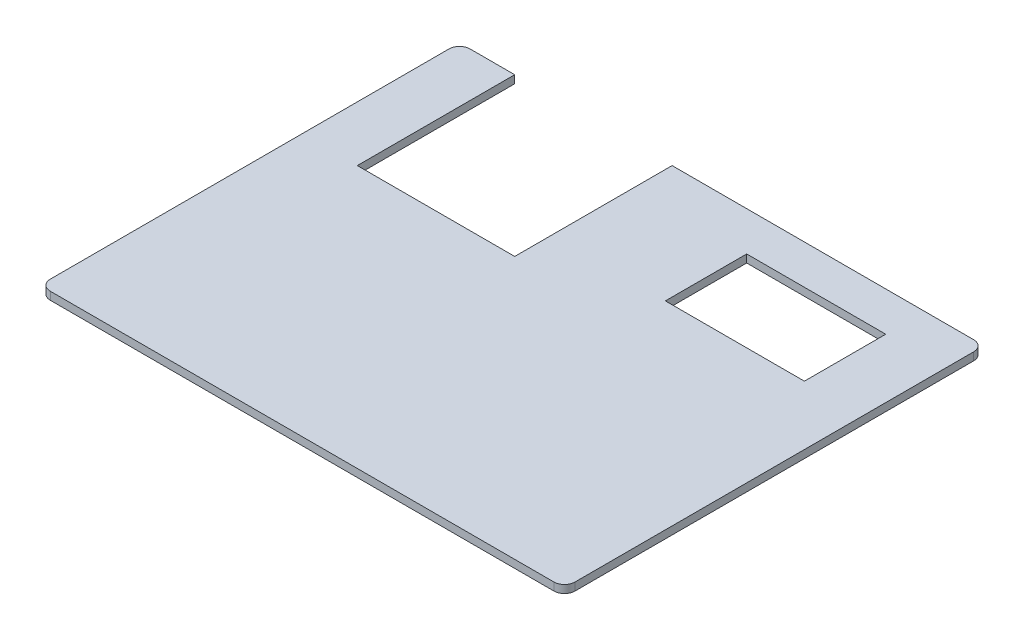
ISO-10303-21;
HEADER;
FILE_DESCRIPTION(('STEP AP214'),'2;1');
FILE_NAME('part.step','',(''),(''),'','','');
FILE_SCHEMA(('AUTOMOTIVE_DESIGN { 1 0 10303 214 1 1 1 1 }'));
ENDSEC;
DATA;
#1=APPLICATION_CONTEXT('core data for automotive mechanical design processes');
#2=APPLICATION_PROTOCOL_DEFINITION('international standard','automotive_design',2000,#1);
#3=PRODUCT_CONTEXT('',#1,'mechanical');
#4=PRODUCT('Part','Part','',(#3));
#5=PRODUCT_RELATED_PRODUCT_CATEGORY('part','',(#4));
#6=PRODUCT_DEFINITION_FORMATION('','',#4);
#7=PRODUCT_DEFINITION_CONTEXT('part definition',#1,'design');
#8=PRODUCT_DEFINITION('design','',#6,#7);
#9=PRODUCT_DEFINITION_SHAPE('','',#8);
#10=(LENGTH_UNIT() NAMED_UNIT(*) SI_UNIT(.MILLI.,.METRE.));
#11=(NAMED_UNIT(*) PLANE_ANGLE_UNIT() SI_UNIT($,.RADIAN.));
#12=(NAMED_UNIT(*) SI_UNIT($,.STERADIAN.) SOLID_ANGLE_UNIT());
#13=UNCERTAINTY_MEASURE_WITH_UNIT(LENGTH_MEASURE(1.E-05),#10,'distance_accuracy_value','');
#14=(GEOMETRIC_REPRESENTATION_CONTEXT(3) GLOBAL_UNCERTAINTY_ASSIGNED_CONTEXT((#13)) GLOBAL_UNIT_ASSIGNED_CONTEXT((#10,
#11,#12)) REPRESENTATION_CONTEXT('',''));
#15=CARTESIAN_POINT('',(0.,0.,0.));
#16=DIRECTION('',(0.,0.,1.));
#17=DIRECTION('',(1.,0.,0.));
#18=AXIS2_PLACEMENT_3D('',#15,#16,#17);
#19=CARTESIAN_POINT('',(0.,1.5,0.));
#20=DIRECTION('',(0.,1.,0.));
#21=DIRECTION('',(0.,0.,1.));
#22=AXIS2_PLACEMENT_3D('',#19,#20,#21);
#23=PLANE('',#22);
#24=DIRECTION('',(0.,0.,1.));
#25=VECTOR('',#24,1.);
#26=CARTESIAN_POINT('',(-16.5457682624405,1.5,-48.8118811881188));
#27=LINE('',#26,#25);
#28=CARTESIAN_POINT('',(-16.5457682624405,1.5,-48.8118811881188));
#29=VERTEX_POINT('',#28);
#30=CARTESIAN_POINT('',(-16.5457682624405,1.5,-18.8118811881188));
#31=VERTEX_POINT('',#30);
#32=EDGE_CURVE('E206',#29,#31,#27,.T.);
#33=ORIENTED_EDGE('',*,*,#32,.F.);
#34=DIRECTION('',(-1.,0.,0.));
#35=VECTOR('',#34,1.);
#36=CARTESIAN_POINT('',(-27.0627062706271,1.5,-48.8118811881188));
#37=LINE('',#36,#35);
#38=CARTESIAN_POINT('',(-25.0627062706271,1.5,-48.8118811881188));
#39=VERTEX_POINT('',#38);
#40=EDGE_CURVE('E244',#29,#39,#37,.T.);
#41=ORIENTED_EDGE('',*,*,#40,.T.);
#42=CARTESIAN_POINT('',(-25.0627062706271,1.5,-46.8118811881188));
#43=DIRECTION('',(0.,1.,0.));
#44=DIRECTION('',(0.,0.,1.));
#45=AXIS2_PLACEMENT_3D('',#42,#43,#44);
#46=CIRCLE('',#45,2.);
#47=CARTESIAN_POINT('',(-27.0627062706271,1.5,-46.8118811881188));
#48=VERTEX_POINT('',#47);
#49=EDGE_CURVE('E297',#39,#48,#46,.T.);
#50=ORIENTED_EDGE('',*,*,#49,.T.);
#51=DIRECTION('',(0.,0.,1.));
#52=VECTOR('',#51,1.);
#53=CARTESIAN_POINT('',(-27.0627062706271,1.5,-48.8118811881188));
#54=LINE('',#53,#52);
#55=CARTESIAN_POINT('',(-27.0627062706271,1.5,29.1881188118812));
#56=VERTEX_POINT('',#55);
#57=EDGE_CURVE('E231',#48,#56,#54,.T.);
#58=ORIENTED_EDGE('',*,*,#57,.T.);
#59=CARTESIAN_POINT('',(-25.0627062706271,1.5,29.1881188118812));
#60=DIRECTION('',(0.,1.,0.));
#61=DIRECTION('',(0.,0.,1.));
#62=AXIS2_PLACEMENT_3D('',#59,#60,#61);
#63=CIRCLE('',#62,2.);
#64=CARTESIAN_POINT('',(-25.0627062706271,1.5,31.1881188118812));
#65=VERTEX_POINT('',#64);
#66=EDGE_CURVE('E300',#56,#65,#63,.T.);
#67=ORIENTED_EDGE('',*,*,#66,.T.);
#68=DIRECTION('',(1.,0.,0.));
#69=VECTOR('',#68,1.);
#70=CARTESIAN_POINT('',(-27.0627062706271,1.5,31.1881188118812));
#71=LINE('',#70,#69);
#72=CARTESIAN_POINT('',(70.937293729373,1.5,31.1881188118812));
#73=VERTEX_POINT('',#72);
#74=EDGE_CURVE('E235',#65,#73,#71,.T.);
#75=ORIENTED_EDGE('',*,*,#74,.T.);
#76=CARTESIAN_POINT('',(70.937293729373,1.5,29.1881188118812));
#77=DIRECTION('',(0.,1.,0.));
#78=DIRECTION('',(0.,0.,1.));
#79=AXIS2_PLACEMENT_3D('',#76,#77,#78);
#80=CIRCLE('',#79,2.);
#81=CARTESIAN_POINT('',(72.937293729373,1.5,29.1881188118812));
#82=VERTEX_POINT('',#81);
#83=EDGE_CURVE('E291',#73,#82,#80,.T.);
#84=ORIENTED_EDGE('',*,*,#83,.T.);
#85=DIRECTION('',(0.,0.,-1.));
#86=VECTOR('',#85,1.);
#87=CARTESIAN_POINT('',(72.937293729373,1.5,-48.8118811881188));
#88=LINE('',#87,#86);
#89=CARTESIAN_POINT('',(72.937293729373,1.5,-46.8118811881188));
#90=VERTEX_POINT('',#89);
#91=EDGE_CURVE('E240',#82,#90,#88,.T.);
#92=ORIENTED_EDGE('',*,*,#91,.T.);
#93=CARTESIAN_POINT('',(70.9372937293729,1.5,-46.8118811881188));
#94=DIRECTION('',(0.,1.,0.));
#95=DIRECTION('',(0.,0.,1.));
#96=AXIS2_PLACEMENT_3D('',#93,#94,#95);
#97=CIRCLE('',#96,2.);
#98=CARTESIAN_POINT('',(70.9372937293729,1.5,-48.8118811881188));
#99=VERTEX_POINT('',#98);
#100=EDGE_CURVE('E294',#90,#99,#97,.T.);
#101=ORIENTED_EDGE('',*,*,#100,.T.);
#102=CARTESIAN_POINT('',(13.4542317375595,1.5,-48.8118811881188));
#103=VERTEX_POINT('',#102);
#104=EDGE_CURVE('E245',#99,#103,#37,.T.);
#105=ORIENTED_EDGE('',*,*,#104,.T.);
#106=DIRECTION('',(0.,0.,-1.));
#107=VECTOR('',#106,1.);
#108=CARTESIAN_POINT('',(13.4542317375595,1.5,-48.8118811881188));
#109=LINE('',#108,#107);
#110=CARTESIAN_POINT('',(13.4542317375595,1.5,-18.8118811881188));
#111=VERTEX_POINT('',#110);
#112=EDGE_CURVE('E214',#111,#103,#109,.T.);
#113=ORIENTED_EDGE('',*,*,#112,.F.);
#114=DIRECTION('',(1.,0.,0.));
#115=VECTOR('',#114,1.);
#116=CARTESIAN_POINT('',(-16.5457682624405,1.5,-18.8118811881188));
#117=LINE('',#116,#115);
#118=EDGE_CURVE('E210',#31,#111,#117,.T.);
#119=ORIENTED_EDGE('',*,*,#118,.F.);
#120=EDGE_LOOP('',(#33,#41,#50,#58,#67,#75,#84,#92,#101,#105,#113,#119));
#121=FACE_BOUND('',#120,.T.);
#122=DIRECTION('',(-1.,0.,0.));
#123=VECTOR('',#122,1.);
#124=CARTESIAN_POINT('',(0.,1.5,-25.833205548279));
#125=LINE('',#124,#123);
#126=CARTESIAN_POINT('',(61.6504997430114,1.5,-25.833205548279));
#127=VERTEX_POINT('',#126);
#128=CARTESIAN_POINT('',(35.1504997430114,1.5,-25.833205548279));
#129=VERTEX_POINT('',#128);
#130=EDGE_CURVE('E201',#127,#129,#125,.T.);
#131=ORIENTED_EDGE('',*,*,#130,.T.);
#132=DIRECTION('',(0.,0.,-1.));
#133=VECTOR('',#132,1.);
#134=CARTESIAN_POINT('',(35.1504997430114,1.5,0.));
#135=LINE('',#134,#133);
#136=CARTESIAN_POINT('',(35.1504997430114,1.5,-41.333205548279));
#137=VERTEX_POINT('',#136);
#138=EDGE_CURVE('E160',#129,#137,#135,.T.);
#139=ORIENTED_EDGE('',*,*,#138,.T.);
#140=DIRECTION('',(1.,0.,0.));
#141=VECTOR('',#140,1.);
#142=CARTESIAN_POINT('',(0.,1.5,-41.333205548279));
#143=LINE('',#142,#141);
#144=CARTESIAN_POINT('',(61.6504997430114,1.5,-41.333205548279));
#145=VERTEX_POINT('',#144);
#146=EDGE_CURVE('E164',#137,#145,#143,.T.);
#147=ORIENTED_EDGE('',*,*,#146,.T.);
#148=DIRECTION('',(0.,0.,1.));
#149=VECTOR('',#148,1.);
#150=CARTESIAN_POINT('',(61.6504997430114,1.5,0.));
#151=LINE('',#150,#149);
#152=EDGE_CURVE('E197',#145,#127,#151,.T.);
#153=ORIENTED_EDGE('',*,*,#152,.T.);
#154=EDGE_LOOP('',(#131,#139,#147,#153));
#155=FACE_BOUND('',#154,.T.);
#156=ADVANCED_FACE('F43',(#121,#155),#23,.T.);
#157=CARTESIAN_POINT('',(0.,0.,0.));
#158=DIRECTION('',(0.,1.,0.));
#159=DIRECTION('',(0.,0.,1.));
#160=AXIS2_PLACEMENT_3D('',#157,#158,#159);
#161=PLANE('',#160);
#162=DIRECTION('',(-1.,0.,0.));
#163=VECTOR('',#162,1.);
#164=CARTESIAN_POINT('',(-27.0627062706271,0.,-48.8118811881188));
#165=LINE('',#164,#163);
#166=CARTESIAN_POINT('',(-16.5457682624405,0.,-48.8118811881188));
#167=VERTEX_POINT('',#166);
#168=CARTESIAN_POINT('',(-25.0627062706271,0.,-48.8118811881188));
#169=VERTEX_POINT('',#168);
#170=EDGE_CURVE('E261',#167,#169,#165,.T.);
#171=ORIENTED_EDGE('',*,*,#170,.F.);
#172=DIRECTION('',(0.,0.,1.));
#173=VECTOR('',#172,1.);
#174=CARTESIAN_POINT('',(-16.5457682624405,0.,0.));
#175=LINE('',#174,#173);
#176=CARTESIAN_POINT('',(-16.5457682624405,0.,-18.8118811881188));
#177=VERTEX_POINT('',#176);
#178=EDGE_CURVE('E11',#167,#177,#175,.T.);
#179=ORIENTED_EDGE('',*,*,#178,.T.);
#180=DIRECTION('',(1.,0.,0.));
#181=VECTOR('',#180,1.);
#182=CARTESIAN_POINT('',(0.,0.,-18.8118811881188));
#183=LINE('',#182,#181);
#184=CARTESIAN_POINT('',(13.4542317375595,0.,-18.8118811881188));
#185=VERTEX_POINT('',#184);
#186=EDGE_CURVE('E318',#177,#185,#183,.T.);
#187=ORIENTED_EDGE('',*,*,#186,.T.);
#188=DIRECTION('',(0.,0.,-1.));
#189=VECTOR('',#188,1.);
#190=CARTESIAN_POINT('',(13.4542317375595,0.,0.));
#191=LINE('',#190,#189);
#192=CARTESIAN_POINT('',(13.4542317375595,0.,-48.8118811881188));
#193=VERTEX_POINT('',#192);
#194=EDGE_CURVE('E52',#185,#193,#191,.T.);
#195=ORIENTED_EDGE('',*,*,#194,.T.);
#196=CARTESIAN_POINT('',(70.9372937293729,0.,-48.8118811881188));
#197=VERTEX_POINT('',#196);
#198=EDGE_CURVE('E236',#197,#193,#165,.T.);
#199=ORIENTED_EDGE('',*,*,#198,.F.);
#200=CARTESIAN_POINT('',(70.9372937293729,0.,-46.8118811881188));
#201=DIRECTION('',(0.,1.,0.));
#202=DIRECTION('',(0.,0.,1.));
#203=AXIS2_PLACEMENT_3D('',#200,#201,#202);
#204=CIRCLE('',#203,2.);
#205=CARTESIAN_POINT('',(72.937293729373,0.,-46.8118811881188));
#206=VERTEX_POINT('',#205);
#207=EDGE_CURVE('E274',#197,#206,#204,.F.);
#208=ORIENTED_EDGE('',*,*,#207,.T.);
#209=DIRECTION('',(0.,0.,-1.));
#210=VECTOR('',#209,1.);
#211=CARTESIAN_POINT('',(72.937293729373,0.,-48.8118811881188));
#212=LINE('',#211,#210);
#213=CARTESIAN_POINT('',(72.937293729373,0.,29.1881188118812));
#214=VERTEX_POINT('',#213);
#215=EDGE_CURVE('E257',#214,#206,#212,.T.);
#216=ORIENTED_EDGE('',*,*,#215,.F.);
#217=CARTESIAN_POINT('',(70.937293729373,0.,29.1881188118812));
#218=DIRECTION('',(0.,1.,0.));
#219=DIRECTION('',(0.,0.,1.));
#220=AXIS2_PLACEMENT_3D('',#217,#218,#219);
#221=CIRCLE('',#220,2.);
#222=CARTESIAN_POINT('',(70.937293729373,0.,31.1881188118812));
#223=VERTEX_POINT('',#222);
#224=EDGE_CURVE('E271',#214,#223,#221,.F.);
#225=ORIENTED_EDGE('',*,*,#224,.T.);
#226=DIRECTION('',(1.,0.,0.));
#227=VECTOR('',#226,1.);
#228=CARTESIAN_POINT('',(-27.0627062706271,0.,31.1881188118812));
#229=LINE('',#228,#227);
#230=CARTESIAN_POINT('',(-25.0627062706271,0.,31.1881188118812));
#231=VERTEX_POINT('',#230);
#232=EDGE_CURVE('E253',#231,#223,#229,.T.);
#233=ORIENTED_EDGE('',*,*,#232,.F.);
#234=CARTESIAN_POINT('',(-25.0627062706271,0.,29.1881188118812));
#235=DIRECTION('',(0.,1.,0.));
#236=DIRECTION('',(0.,0.,1.));
#237=AXIS2_PLACEMENT_3D('',#234,#235,#236);
#238=CIRCLE('',#237,2.);
#239=CARTESIAN_POINT('',(-27.0627062706271,0.,29.1881188118812));
#240=VERTEX_POINT('',#239);
#241=EDGE_CURVE('E281',#231,#240,#238,.F.);
#242=ORIENTED_EDGE('',*,*,#241,.T.);
#243=DIRECTION('',(0.,0.,1.));
#244=VECTOR('',#243,1.);
#245=CARTESIAN_POINT('',(-27.0627062706271,0.,-48.8118811881188));
#246=LINE('',#245,#244);
#247=CARTESIAN_POINT('',(-27.0627062706271,0.,-46.8118811881188));
#248=VERTEX_POINT('',#247);
#249=EDGE_CURVE('E221',#248,#240,#246,.T.);
#250=ORIENTED_EDGE('',*,*,#249,.F.);
#251=CARTESIAN_POINT('',(-25.0627062706271,0.,-46.8118811881188));
#252=DIRECTION('',(0.,1.,0.));
#253=DIRECTION('',(0.,0.,1.));
#254=AXIS2_PLACEMENT_3D('',#251,#252,#253);
#255=CIRCLE('',#254,2.);
#256=EDGE_CURVE('E277',#248,#169,#255,.F.);
#257=ORIENTED_EDGE('',*,*,#256,.T.);
#258=EDGE_LOOP('',(#171,#179,#187,#195,#199,#208,#216,#225,#233,#242,#250,#257));
#259=FACE_BOUND('',#258,.T.);
#260=DIRECTION('',(0.,0.,1.));
#261=VECTOR('',#260,1.);
#262=CARTESIAN_POINT('',(35.1504997430114,0.,-41.333205548279));
#263=LINE('',#262,#261);
#264=CARTESIAN_POINT('',(35.1504997430114,0.,-41.333205548279));
#265=VERTEX_POINT('',#264);
#266=CARTESIAN_POINT('',(35.1504997430114,0.,-25.833205548279));
#267=VERTEX_POINT('',#266);
#268=EDGE_CURVE('E67',#265,#267,#263,.T.);
#269=ORIENTED_EDGE('',*,*,#268,.T.);
#270=DIRECTION('',(1.,0.,0.));
#271=VECTOR('',#270,1.);
#272=CARTESIAN_POINT('',(35.1504997430114,0.,-25.833205548279));
#273=LINE('',#272,#271);
#274=CARTESIAN_POINT('',(61.6504997430114,0.,-25.833205548279));
#275=VERTEX_POINT('',#274);
#276=EDGE_CURVE('E168',#267,#275,#273,.T.);
#277=ORIENTED_EDGE('',*,*,#276,.T.);
#278=DIRECTION('',(0.,0.,-1.));
#279=VECTOR('',#278,1.);
#280=CARTESIAN_POINT('',(61.6504997430114,0.,-41.333205548279));
#281=LINE('',#280,#279);
#282=CARTESIAN_POINT('',(61.6504997430114,0.,-41.333205548279));
#283=VERTEX_POINT('',#282);
#284=EDGE_CURVE('E175',#275,#283,#281,.T.);
#285=ORIENTED_EDGE('',*,*,#284,.T.);
#286=DIRECTION('',(-1.,0.,0.));
#287=VECTOR('',#286,1.);
#288=CARTESIAN_POINT('',(35.1504997430114,0.,-41.333205548279));
#289=LINE('',#288,#287);
#290=EDGE_CURVE('E179',#283,#265,#289,.T.);
#291=ORIENTED_EDGE('',*,*,#290,.T.);
#292=EDGE_LOOP('',(#269,#277,#285,#291));
#293=FACE_BOUND('',#292,.T.);
#294=ADVANCED_FACE('F178',(#259,#293),#161,.F.);
#295=CARTESIAN_POINT('',(-27.0627062706271,1.5,-48.8118811881188));
#296=DIRECTION('',(0.,0.,1.));
#297=DIRECTION('',(1.,0.,0.));
#298=AXIS2_PLACEMENT_3D('',#295,#296,#297);
#299=PLANE('',#298);
#300=ORIENTED_EDGE('',*,*,#40,.F.);
#301=DIRECTION('',(0.,1.,0.));
#302=VECTOR('',#301,1.);
#303=CARTESIAN_POINT('',(-16.5457682624405,-6.,-48.8118811881188));
#304=LINE('',#303,#302);
#305=EDGE_CURVE('E218',#167,#29,#304,.T.);
#306=ORIENTED_EDGE('',*,*,#305,.F.);
#307=ORIENTED_EDGE('',*,*,#170,.T.);
#308=DIRECTION('',(0.,-1.,0.));
#309=VECTOR('',#308,1.);
#310=CARTESIAN_POINT('',(-25.0627062706271,1.5,-48.8118811881188));
#311=LINE('',#310,#309);
#312=EDGE_CURVE('E307',#169,#39,#311,.F.);
#313=ORIENTED_EDGE('',*,*,#312,.T.);
#314=EDGE_LOOP('',(#300,#306,#307,#313));
#315=FACE_BOUND('',#314,.T.);
#316=ADVANCED_FACE('F371',(#315),#299,.F.);
#317=CARTESIAN_POINT('',(-27.0627062706271,1.5,-48.8118811881188));
#318=DIRECTION('',(1.,0.,0.));
#319=DIRECTION('',(0.,0.,-1.));
#320=AXIS2_PLACEMENT_3D('',#317,#318,#319);
#321=PLANE('',#320);
#322=ORIENTED_EDGE('',*,*,#249,.T.);
#323=DIRECTION('',(0.,-1.,0.));
#324=VECTOR('',#323,1.);
#325=CARTESIAN_POINT('',(-27.0627062706271,1.5,29.1881188118812));
#326=LINE('',#325,#324);
#327=EDGE_CURVE('E288',#240,#56,#326,.F.);
#328=ORIENTED_EDGE('',*,*,#327,.T.);
#329=ORIENTED_EDGE('',*,*,#57,.F.);
#330=DIRECTION('',(0.,-1.,0.));
#331=VECTOR('',#330,1.);
#332=CARTESIAN_POINT('',(-27.0627062706271,1.5,-46.8118811881188));
#333=LINE('',#332,#331);
#334=EDGE_CURVE('E284',#48,#248,#333,.T.);
#335=ORIENTED_EDGE('',*,*,#334,.T.);
#336=EDGE_LOOP('',(#322,#328,#329,#335));
#337=FACE_BOUND('',#336,.T.);
#338=ADVANCED_FACE('F355',(#337),#321,.F.);
#339=CARTESIAN_POINT('',(-27.0627062706271,1.5,31.1881188118812));
#340=DIRECTION('',(0.,0.,-1.));
#341=DIRECTION('',(-1.,0.,0.));
#342=AXIS2_PLACEMENT_3D('',#339,#340,#341);
#343=PLANE('',#342);
#344=ORIENTED_EDGE('',*,*,#74,.F.);
#345=DIRECTION('',(0.,-1.,0.));
#346=VECTOR('',#345,1.);
#347=CARTESIAN_POINT('',(-25.0627062706271,1.5,31.1881188118812));
#348=LINE('',#347,#346);
#349=EDGE_CURVE('E267',#65,#231,#348,.T.);
#350=ORIENTED_EDGE('',*,*,#349,.T.);
#351=ORIENTED_EDGE('',*,*,#232,.T.);
#352=DIRECTION('',(0.,-1.,0.));
#353=VECTOR('',#352,1.);
#354=CARTESIAN_POINT('',(70.937293729373,1.5,31.1881188118812));
#355=LINE('',#354,#353);
#356=EDGE_CURVE('E249',#223,#73,#355,.F.);
#357=ORIENTED_EDGE('',*,*,#356,.T.);
#358=EDGE_LOOP('',(#344,#350,#351,#357));
#359=FACE_BOUND('',#358,.T.);
#360=ADVANCED_FACE('F347',(#359),#343,.F.);
#361=CARTESIAN_POINT('',(72.937293729373,1.5,-48.8118811881188));
#362=DIRECTION('',(-1.,0.,0.));
#363=DIRECTION('',(0.,0.,1.));
#364=AXIS2_PLACEMENT_3D('',#361,#362,#363);
#365=PLANE('',#364);
#366=ORIENTED_EDGE('',*,*,#215,.T.);
#367=DIRECTION('',(0.,-1.,0.));
#368=VECTOR('',#367,1.);
#369=CARTESIAN_POINT('',(72.937293729373,1.5,-46.8118811881188));
#370=LINE('',#369,#368);
#371=EDGE_CURVE('E315',#206,#90,#370,.F.);
#372=ORIENTED_EDGE('',*,*,#371,.T.);
#373=ORIENTED_EDGE('',*,*,#91,.F.);
#374=DIRECTION('',(0.,-1.,0.));
#375=VECTOR('',#374,1.);
#376=CARTESIAN_POINT('',(72.937293729373,1.5,29.1881188118812));
#377=LINE('',#376,#375);
#378=EDGE_CURVE('E311',#82,#214,#377,.T.);
#379=ORIENTED_EDGE('',*,*,#378,.T.);
#380=EDGE_LOOP('',(#366,#372,#373,#379));
#381=FACE_BOUND('',#380,.T.);
#382=ADVANCED_FACE('F338',(#381),#365,.F.);
#383=ORIENTED_EDGE('',*,*,#198,.T.);
#384=DIRECTION('',(0.,1.,0.));
#385=VECTOR('',#384,1.);
#386=CARTESIAN_POINT('',(13.4542317375595,-6.,-48.8118811881188));
#387=LINE('',#386,#385);
#388=EDGE_CURVE('E222',#193,#103,#387,.T.);
#389=ORIENTED_EDGE('',*,*,#388,.T.);
#390=ORIENTED_EDGE('',*,*,#104,.F.);
#391=DIRECTION('',(0.,-1.,0.));
#392=VECTOR('',#391,1.);
#393=CARTESIAN_POINT('',(70.9372937293729,1.5,-48.8118811881188));
#394=LINE('',#393,#392);
#395=EDGE_CURVE('E303',#99,#197,#394,.T.);
#396=ORIENTED_EDGE('',*,*,#395,.T.);
#397=EDGE_LOOP('',(#383,#389,#390,#396));
#398=FACE_BOUND('',#397,.T.);
#399=ADVANCED_FACE('F329',(#398),#299,.F.);
#400=CARTESIAN_POINT('',(-25.0627062706271,1.5,29.1881188118812));
#401=DIRECTION('',(0.,-1.,0.));
#402=DIRECTION('',(0.,0.,-1.));
#403=AXIS2_PLACEMENT_3D('',#400,#401,#402);
#404=CYLINDRICAL_SURFACE('',#403,2.);
#405=ORIENTED_EDGE('',*,*,#66,.F.);
#406=ORIENTED_EDGE('',*,*,#327,.F.);
#407=ORIENTED_EDGE('',*,*,#241,.F.);
#408=ORIENTED_EDGE('',*,*,#349,.F.);
#409=EDGE_LOOP('',(#405,#406,#407,#408));
#410=FACE_BOUND('',#409,.T.);
#411=ADVANCED_FACE('F351',(#410),#404,.T.);
#412=CARTESIAN_POINT('',(-25.0627062706271,1.5,-46.8118811881188));
#413=DIRECTION('',(0.,-1.,0.));
#414=DIRECTION('',(0.,0.,-1.));
#415=AXIS2_PLACEMENT_3D('',#412,#413,#414);
#416=CYLINDRICAL_SURFACE('',#415,2.);
#417=ORIENTED_EDGE('',*,*,#49,.F.);
#418=ORIENTED_EDGE('',*,*,#312,.F.);
#419=ORIENTED_EDGE('',*,*,#256,.F.);
#420=ORIENTED_EDGE('',*,*,#334,.F.);
#421=EDGE_LOOP('',(#417,#418,#419,#420));
#422=FACE_BOUND('',#421,.T.);
#423=ADVANCED_FACE('F360',(#422),#416,.T.);
#424=CARTESIAN_POINT('',(70.9372937293729,1.5,-46.8118811881188));
#425=DIRECTION('',(0.,-1.,0.));
#426=DIRECTION('',(0.,0.,-1.));
#427=AXIS2_PLACEMENT_3D('',#424,#425,#426);
#428=CYLINDRICAL_SURFACE('',#427,2.);
#429=ORIENTED_EDGE('',*,*,#100,.F.);
#430=ORIENTED_EDGE('',*,*,#371,.F.);
#431=ORIENTED_EDGE('',*,*,#207,.F.);
#432=ORIENTED_EDGE('',*,*,#395,.F.);
#433=EDGE_LOOP('',(#429,#430,#431,#432));
#434=FACE_BOUND('',#433,.T.);
#435=ADVANCED_FACE('F334',(#434),#428,.T.);
#436=CARTESIAN_POINT('',(70.937293729373,1.5,29.1881188118812));
#437=DIRECTION('',(0.,-1.,0.));
#438=DIRECTION('',(0.,0.,-1.));
#439=AXIS2_PLACEMENT_3D('',#436,#437,#438);
#440=CYLINDRICAL_SURFACE('',#439,2.);
#441=ORIENTED_EDGE('',*,*,#83,.F.);
#442=ORIENTED_EDGE('',*,*,#356,.F.);
#443=ORIENTED_EDGE('',*,*,#224,.F.);
#444=ORIENTED_EDGE('',*,*,#378,.F.);
#445=EDGE_LOOP('',(#441,#442,#443,#444));
#446=FACE_BOUND('',#445,.T.);
#447=ADVANCED_FACE('F45',(#446),#440,.T.);
#448=CARTESIAN_POINT('',(-16.5457682624405,-6.,-48.8118811881188));
#449=DIRECTION('',(-1.,0.,0.));
#450=DIRECTION('',(0.,0.,1.));
#451=AXIS2_PLACEMENT_3D('',#448,#449,#450);
#452=PLANE('',#451);
#453=ORIENTED_EDGE('',*,*,#305,.T.);
#454=ORIENTED_EDGE('',*,*,#32,.T.);
#455=DIRECTION('',(0.,1.,0.));
#456=VECTOR('',#455,1.);
#457=CARTESIAN_POINT('',(-16.5457682624405,-6.,-18.8118811881188));
#458=LINE('',#457,#456);
#459=EDGE_CURVE('E217',#177,#31,#458,.T.);
#460=ORIENTED_EDGE('',*,*,#459,.F.);
#461=ORIENTED_EDGE('',*,*,#178,.F.);
#462=EDGE_LOOP('',(#453,#454,#460,#461));
#463=FACE_BOUND('',#462,.T.);
#464=ADVANCED_FACE('F387',(#463),#452,.F.);
#465=CARTESIAN_POINT('',(13.4542317375595,-6.,-48.8118811881188));
#466=DIRECTION('',(1.,0.,0.));
#467=DIRECTION('',(0.,0.,-1.));
#468=AXIS2_PLACEMENT_3D('',#465,#466,#467);
#469=PLANE('',#468);
#470=DIRECTION('',(0.,1.,0.));
#471=VECTOR('',#470,1.);
#472=CARTESIAN_POINT('',(13.4542317375595,-6.,-18.8118811881188));
#473=LINE('',#472,#471);
#474=EDGE_CURVE('E226',#185,#111,#473,.T.);
#475=ORIENTED_EDGE('',*,*,#474,.T.);
#476=ORIENTED_EDGE('',*,*,#112,.T.);
#477=ORIENTED_EDGE('',*,*,#388,.F.);
#478=ORIENTED_EDGE('',*,*,#194,.F.);
#479=EDGE_LOOP('',(#475,#476,#477,#478));
#480=FACE_BOUND('',#479,.T.);
#481=ADVANCED_FACE('F390',(#480),#469,.F.);
#482=CARTESIAN_POINT('',(-16.5457682624405,-6.,-18.8118811881188));
#483=DIRECTION('',(0.,0.,1.));
#484=DIRECTION('',(1.,0.,0.));
#485=AXIS2_PLACEMENT_3D('',#482,#483,#484);
#486=PLANE('',#485);
#487=ORIENTED_EDGE('',*,*,#459,.T.);
#488=ORIENTED_EDGE('',*,*,#118,.T.);
#489=ORIENTED_EDGE('',*,*,#474,.F.);
#490=ORIENTED_EDGE('',*,*,#186,.F.);
#491=EDGE_LOOP('',(#487,#488,#489,#490));
#492=FACE_BOUND('',#491,.T.);
#493=ADVANCED_FACE('F392',(#492),#486,.F.);
#494=CARTESIAN_POINT('',(35.1504997430114,10.5,-41.333205548279));
#495=DIRECTION('',(1.,0.,0.));
#496=DIRECTION('',(0.,0.,-1.));
#497=AXIS2_PLACEMENT_3D('',#494,#495,#496);
#498=PLANE('',#497);
#499=DIRECTION('',(0.,-1.,0.));
#500=VECTOR('',#499,1.);
#501=CARTESIAN_POINT('',(35.1504997430114,10.5,-25.833205548279));
#502=LINE('',#501,#500);
#503=EDGE_CURVE('E156',#129,#267,#502,.T.);
#504=ORIENTED_EDGE('',*,*,#503,.T.);
#505=ORIENTED_EDGE('',*,*,#268,.F.);
#506=DIRECTION('',(0.,-1.,0.));
#507=VECTOR('',#506,1.);
#508=CARTESIAN_POINT('',(35.1504997430114,10.5,-41.333205548279));
#509=LINE('',#508,#507);
#510=EDGE_CURVE('E187',#137,#265,#509,.T.);
#511=ORIENTED_EDGE('',*,*,#510,.F.);
#512=ORIENTED_EDGE('',*,*,#138,.F.);
#513=EDGE_LOOP('',(#504,#505,#511,#512));
#514=FACE_BOUND('',#513,.T.);
#515=ADVANCED_FACE('F158',(#514),#498,.T.);
#516=CARTESIAN_POINT('',(35.1504997430114,10.5,-25.833205548279));
#517=DIRECTION('',(0.,0.,-1.));
#518=DIRECTION('',(-1.,0.,0.));
#519=AXIS2_PLACEMENT_3D('',#516,#517,#518);
#520=PLANE('',#519);
#521=DIRECTION('',(0.,-1.,0.));
#522=VECTOR('',#521,1.);
#523=CARTESIAN_POINT('',(61.6504997430114,10.5,-25.833205548279));
#524=LINE('',#523,#522);
#525=EDGE_CURVE('E165',#127,#275,#524,.T.);
#526=ORIENTED_EDGE('',*,*,#525,.T.);
#527=ORIENTED_EDGE('',*,*,#276,.F.);
#528=ORIENTED_EDGE('',*,*,#503,.F.);
#529=ORIENTED_EDGE('',*,*,#130,.F.);
#530=EDGE_LOOP('',(#526,#527,#528,#529));
#531=FACE_BOUND('',#530,.T.);
#532=ADVANCED_FACE('F169',(#531),#520,.T.);
#533=CARTESIAN_POINT('',(61.6504997430114,10.5,-41.333205548279));
#534=DIRECTION('',(-1.,0.,0.));
#535=DIRECTION('',(0.,0.,1.));
#536=AXIS2_PLACEMENT_3D('',#533,#534,#535);
#537=PLANE('',#536);
#538=DIRECTION('',(0.,-1.,0.));
#539=VECTOR('',#538,1.);
#540=CARTESIAN_POINT('',(61.6504997430114,10.5,-41.333205548279));
#541=LINE('',#540,#539);
#542=EDGE_CURVE('E59',#145,#283,#541,.T.);
#543=ORIENTED_EDGE('',*,*,#542,.T.);
#544=ORIENTED_EDGE('',*,*,#284,.F.);
#545=ORIENTED_EDGE('',*,*,#525,.F.);
#546=ORIENTED_EDGE('',*,*,#152,.F.);
#547=EDGE_LOOP('',(#543,#544,#545,#546));
#548=FACE_BOUND('',#547,.T.);
#549=ADVANCED_FACE('F402',(#548),#537,.T.);
#550=CARTESIAN_POINT('',(35.1504997430114,10.5,-41.333205548279));
#551=DIRECTION('',(0.,0.,1.));
#552=DIRECTION('',(1.,0.,0.));
#553=AXIS2_PLACEMENT_3D('',#550,#551,#552);
#554=PLANE('',#553);
#555=ORIENTED_EDGE('',*,*,#510,.T.);
#556=ORIENTED_EDGE('',*,*,#290,.F.);
#557=ORIENTED_EDGE('',*,*,#542,.F.);
#558=ORIENTED_EDGE('',*,*,#146,.F.);
#559=EDGE_LOOP('',(#555,#556,#557,#558));
#560=FACE_BOUND('',#559,.T.);
#561=ADVANCED_FACE('F405',(#560),#554,.T.);
#562=CLOSED_SHELL('',(#156,#294,#316,#338,#360,#382,#399,#411,#423,#435,#447,#464,#481,#493,
#515,#532,#549,#561));
#563=MANIFOLD_SOLID_BREP('B2',#562);
#564=ADVANCED_BREP_SHAPE_REPRESENTATION('',(#18,#563),#14);
#565=SHAPE_DEFINITION_REPRESENTATION(#9,#564);
ENDSEC;
END-ISO-10303-21;
